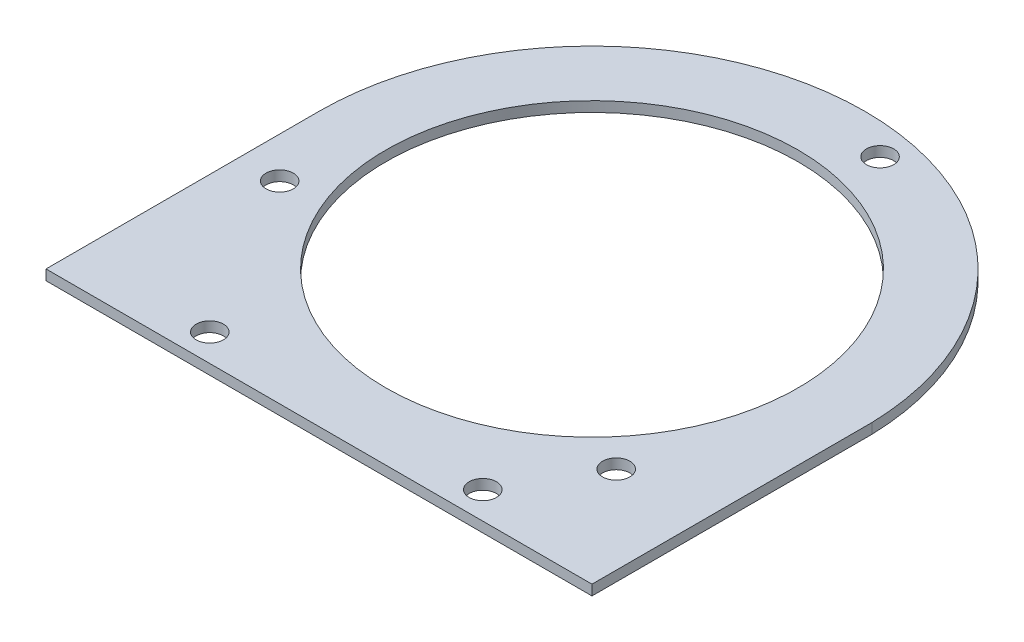
ISO-10303-21;
HEADER;
FILE_DESCRIPTION(('STEP AP214'),'2;1');
FILE_NAME('part.step','',(''),(''),'','','');
FILE_SCHEMA(('AUTOMOTIVE_DESIGN { 1 0 10303 214 1 1 1 1 }'));
ENDSEC;
DATA;
#1=APPLICATION_CONTEXT('core data for automotive mechanical design processes');
#2=APPLICATION_PROTOCOL_DEFINITION('international standard','automotive_design',2000,#1);
#3=PRODUCT_CONTEXT('',#1,'mechanical');
#4=PRODUCT('Part','Part','',(#3));
#5=PRODUCT_RELATED_PRODUCT_CATEGORY('part','',(#4));
#6=PRODUCT_DEFINITION_FORMATION('','',#4);
#7=PRODUCT_DEFINITION_CONTEXT('part definition',#1,'design');
#8=PRODUCT_DEFINITION('design','',#6,#7);
#9=PRODUCT_DEFINITION_SHAPE('','',#8);
#10=(LENGTH_UNIT() NAMED_UNIT(*) SI_UNIT(.MILLI.,.METRE.));
#11=(NAMED_UNIT(*) PLANE_ANGLE_UNIT() SI_UNIT($,.RADIAN.));
#12=(NAMED_UNIT(*) SI_UNIT($,.STERADIAN.) SOLID_ANGLE_UNIT());
#13=UNCERTAINTY_MEASURE_WITH_UNIT(LENGTH_MEASURE(1.E-05),#10,'distance_accuracy_value','');
#14=(GEOMETRIC_REPRESENTATION_CONTEXT(3) GLOBAL_UNCERTAINTY_ASSIGNED_CONTEXT((#13)) GLOBAL_UNIT_ASSIGNED_CONTEXT((#10,
#11,#12)) REPRESENTATION_CONTEXT('',''));
#15=CARTESIAN_POINT('',(0.,0.,0.));
#16=DIRECTION('',(0.,0.,1.));
#17=DIRECTION('',(1.,0.,0.));
#18=AXIS2_PLACEMENT_3D('',#15,#16,#17);
#19=CARTESIAN_POINT('',(2.28983498828939E-13,4.7625,0.0407051282049001));
#20=DIRECTION('',(0.,-1.,0.));
#21=DIRECTION('',(0.,0.,-1.));
#22=AXIS2_PLACEMENT_3D('',#19,#20,#21);
#23=PLANE('',#22);
#24=CARTESIAN_POINT('',(2.28983498828939E-13,4.7625,0.0407051282049001));
#25=DIRECTION('',(0.,1.,0.));
#26=DIRECTION('',(0.,0.,-1.));
#27=AXIS2_PLACEMENT_3D('',#24,#25,#26);
#28=CIRCLE('',#27,127.040705128219);
#29=CARTESIAN_POINT('',(127.,4.7625,-3.17500000000001));
#30=VERTEX_POINT('',#29);
#31=CARTESIAN_POINT('',(6.581727052258E-09,4.7625,-127.000000000014));
#32=VERTEX_POINT('',#31);
#33=EDGE_CURVE('E114',#30,#32,#28,.T.);
#34=ORIENTED_EDGE('',*,*,#33,.T.);
#35=CARTESIAN_POINT('',(2.63677968348475E-13,4.7625,3.05311331771918E-13));
#36=DIRECTION('',(0.,1.,0.));
#37=DIRECTION('',(0.,0.,-1.));
#38=AXIS2_PLACEMENT_3D('',#35,#36,#37);
#39=CIRCLE('',#38,127.000000000015);
#40=CARTESIAN_POINT('',(-127.000000000014,4.7625,0.));
#41=VERTEX_POINT('',#40);
#42=EDGE_CURVE('E81',#32,#41,#39,.T.);
#43=ORIENTED_EDGE('',*,*,#42,.T.);
#44=DIRECTION('',(0.,0.,1.));
#45=VECTOR('',#44,1.);
#46=CARTESIAN_POINT('',(-127.,4.7625,127.));
#47=LINE('',#46,#45);
#48=CARTESIAN_POINT('',(-127.,4.7625,127.));
#49=VERTEX_POINT('',#48);
#50=EDGE_CURVE('E85',#41,#49,#47,.T.);
#51=ORIENTED_EDGE('',*,*,#50,.T.);
#52=DIRECTION('',(1.,0.,0.));
#53=VECTOR('',#52,1.);
#54=CARTESIAN_POINT('',(127.,4.7625,127.));
#55=LINE('',#54,#53);
#56=CARTESIAN_POINT('',(127.,4.7625,127.));
#57=VERTEX_POINT('',#56);
#58=EDGE_CURVE('E89',#49,#57,#55,.T.);
#59=ORIENTED_EDGE('',*,*,#58,.T.);
#60=DIRECTION('',(0.,0.,-1.));
#61=VECTOR('',#60,1.);
#62=CARTESIAN_POINT('',(127.,4.7625,127.));
#63=LINE('',#62,#61);
#64=EDGE_CURVE('E47',#57,#30,#63,.T.);
#65=ORIENTED_EDGE('',*,*,#64,.T.);
#66=EDGE_LOOP('',(#34,#43,#51,#59,#65));
#67=FACE_BOUND('',#66,.T.);
#68=CARTESIAN_POINT('',(0.,4.7625,0.));
#69=DIRECTION('',(0.,1.,0.));
#70=DIRECTION('',(0.,0.,1.));
#71=AXIS2_PLACEMENT_3D('',#68,#69,#70);
#72=CIRCLE('',#71,95.885);
#73=CARTESIAN_POINT('',(0.,4.7625,95.885));
#74=VERTEX_POINT('',#73);
#75=EDGE_CURVE('E109',#74,#74,#72,.T.);
#76=ORIENTED_EDGE('',*,*,#75,.F.);
#77=EDGE_LOOP('',(#76));
#78=FACE_BOUND('',#77,.T.);
#79=CARTESIAN_POINT('',(-108.072773191002,4.7625,37.2124400544523));
#80=DIRECTION('',(0.,1.,0.));
#81=DIRECTION('',(0.,0.,1.));
#82=AXIS2_PLACEMENT_3D('',#79,#80,#81);
#83=CIRCLE('',#82,6.35);
#84=CARTESIAN_POINT('',(-108.072773191002,4.7625,43.5624400544523));
#85=VERTEX_POINT('',#84);
#86=EDGE_CURVE('E193',#85,#85,#83,.T.);
#87=ORIENTED_EDGE('',*,*,#86,.F.);
#88=EDGE_LOOP('',(#87));
#89=FACE_BOUND('',#88,.T.);
#90=CARTESIAN_POINT('',(-63.5,4.7625,114.3));
#91=DIRECTION('',(0.,1.,0.));
#92=DIRECTION('',(0.,0.,1.));
#93=AXIS2_PLACEMENT_3D('',#90,#91,#92);
#94=CIRCLE('',#93,6.35);
#95=CARTESIAN_POINT('',(-63.5,4.7625,120.65));
#96=VERTEX_POINT('',#95);
#97=EDGE_CURVE('E187',#96,#96,#94,.T.);
#98=ORIENTED_EDGE('',*,*,#97,.F.);
#99=EDGE_LOOP('',(#98));
#100=FACE_BOUND('',#99,.T.);
#101=CARTESIAN_POINT('',(63.5000000000001,4.7625,114.3));
#102=DIRECTION('',(0.,1.,0.));
#103=DIRECTION('',(0.,0.,-1.));
#104=AXIS2_PLACEMENT_3D('',#101,#102,#103);
#105=CIRCLE('',#104,6.34999999999999);
#106=CARTESIAN_POINT('',(63.5000000000001,4.7625,107.95));
#107=VERTEX_POINT('',#106);
#108=EDGE_CURVE('E181',#107,#107,#105,.T.);
#109=ORIENTED_EDGE('',*,*,#108,.F.);
#110=EDGE_LOOP('',(#109));
#111=FACE_BOUND('',#110,.T.);
#112=CARTESIAN_POINT('',(21.8094681715398,4.7625,-112.199987068068));
#113=DIRECTION('',(0.,1.,0.));
#114=DIRECTION('',(0.,0.,1.));
#115=AXIS2_PLACEMENT_3D('',#112,#113,#114);
#116=CIRCLE('',#115,6.34999999999998);
#117=CARTESIAN_POINT('',(21.8094681715398,4.7625,-105.849987068068));
#118=VERTEX_POINT('',#117);
#119=EDGE_CURVE('E175',#118,#118,#116,.T.);
#120=ORIENTED_EDGE('',*,*,#119,.F.);
#121=EDGE_LOOP('',(#120));
#122=FACE_BOUND('',#121,.T.);
#123=CARTESIAN_POINT('',(86.2633050194624,4.7625,74.9875470136155));
#124=DIRECTION('',(0.,1.,0.));
#125=DIRECTION('',(0.,0.,1.));
#126=AXIS2_PLACEMENT_3D('',#123,#124,#125);
#127=CIRCLE('',#126,6.34999999999999);
#128=CARTESIAN_POINT('',(86.2633050194624,4.7625,81.3375470136155));
#129=VERTEX_POINT('',#128);
#130=EDGE_CURVE('E166',#129,#129,#127,.T.);
#131=ORIENTED_EDGE('',*,*,#130,.F.);
#132=EDGE_LOOP('',(#131));
#133=FACE_BOUND('',#132,.T.);
#134=ADVANCED_FACE('F30',(#67,#78,#89,#100,#111,#122,#133),#23,.F.);
#135=CARTESIAN_POINT('',(2.28983498828939E-13,0.,0.0407051282049001));
#136=DIRECTION('',(0.,-1.,0.));
#137=DIRECTION('',(0.,0.,-1.));
#138=AXIS2_PLACEMENT_3D('',#135,#136,#137);
#139=PLANE('',#138);
#140=CARTESIAN_POINT('',(21.8094681715398,0.,-112.199987068068));
#141=DIRECTION('',(0.,1.,0.));
#142=DIRECTION('',(0.,0.,1.));
#143=AXIS2_PLACEMENT_3D('',#140,#141,#142);
#144=CIRCLE('',#143,6.34999999999998);
#145=CARTESIAN_POINT('',(21.8094681715398,0.,-105.849987068068));
#146=VERTEX_POINT('',#145);
#147=EDGE_CURVE('E172',#146,#146,#144,.T.);
#148=ORIENTED_EDGE('',*,*,#147,.T.);
#149=EDGE_LOOP('',(#148));
#150=FACE_BOUND('',#149,.T.);
#151=CARTESIAN_POINT('',(-63.5,0.,114.3));
#152=DIRECTION('',(0.,1.,0.));
#153=DIRECTION('',(0.,0.,1.));
#154=AXIS2_PLACEMENT_3D('',#151,#152,#153);
#155=CIRCLE('',#154,6.35);
#156=CARTESIAN_POINT('',(-63.5,0.,120.65));
#157=VERTEX_POINT('',#156);
#158=EDGE_CURVE('E184',#157,#157,#155,.T.);
#159=ORIENTED_EDGE('',*,*,#158,.T.);
#160=EDGE_LOOP('',(#159));
#161=FACE_BOUND('',#160,.T.);
#162=CARTESIAN_POINT('',(0.,0.,0.));
#163=DIRECTION('',(0.,1.,0.));
#164=DIRECTION('',(0.,0.,1.));
#165=AXIS2_PLACEMENT_3D('',#162,#163,#164);
#166=CIRCLE('',#165,95.885);
#167=CARTESIAN_POINT('',(0.,0.,95.885));
#168=VERTEX_POINT('',#167);
#169=EDGE_CURVE('E196',#168,#168,#166,.T.);
#170=ORIENTED_EDGE('',*,*,#169,.T.);
#171=EDGE_LOOP('',(#170));
#172=FACE_BOUND('',#171,.T.);
#173=CARTESIAN_POINT('',(2.28983498828939E-13,0.,0.0407051282049001));
#174=DIRECTION('',(0.,1.,0.));
#175=DIRECTION('',(0.,0.,-1.));
#176=AXIS2_PLACEMENT_3D('',#173,#174,#175);
#177=CIRCLE('',#176,127.040705128219);
#178=CARTESIAN_POINT('',(127.,0.,-3.17500000000001));
#179=VERTEX_POINT('',#178);
#180=CARTESIAN_POINT('',(6.581727052258E-09,0.,-127.000000000014));
#181=VERTEX_POINT('',#180);
#182=EDGE_CURVE('E105',#179,#181,#177,.T.);
#183=ORIENTED_EDGE('',*,*,#182,.F.);
#184=DIRECTION('',(0.,0.,-1.));
#185=VECTOR('',#184,1.);
#186=CARTESIAN_POINT('',(127.,0.,127.));
#187=LINE('',#186,#185);
#188=CARTESIAN_POINT('',(127.,0.,127.));
#189=VERTEX_POINT('',#188);
#190=EDGE_CURVE('E73',#189,#179,#187,.T.);
#191=ORIENTED_EDGE('',*,*,#190,.F.);
#192=DIRECTION('',(1.,0.,0.));
#193=VECTOR('',#192,1.);
#194=CARTESIAN_POINT('',(127.,0.,127.));
#195=LINE('',#194,#193);
#196=CARTESIAN_POINT('',(-127.,0.,127.));
#197=VERTEX_POINT('',#196);
#198=EDGE_CURVE('E67',#197,#189,#195,.T.);
#199=ORIENTED_EDGE('',*,*,#198,.F.);
#200=DIRECTION('',(0.,0.,1.));
#201=VECTOR('',#200,1.);
#202=CARTESIAN_POINT('',(-127.,0.,127.));
#203=LINE('',#202,#201);
#204=CARTESIAN_POINT('',(-127.000000000014,0.,0.));
#205=VERTEX_POINT('',#204);
#206=EDGE_CURVE('E96',#205,#197,#203,.T.);
#207=ORIENTED_EDGE('',*,*,#206,.F.);
#208=CARTESIAN_POINT('',(2.63677968348475E-13,0.,3.05311331771918E-13));
#209=DIRECTION('',(0.,1.,0.));
#210=DIRECTION('',(0.,0.,-1.));
#211=AXIS2_PLACEMENT_3D('',#208,#209,#210);
#212=CIRCLE('',#211,127.000000000015);
#213=EDGE_CURVE('E108',#181,#205,#212,.T.);
#214=ORIENTED_EDGE('',*,*,#213,.F.);
#215=EDGE_LOOP('',(#183,#191,#199,#207,#214));
#216=FACE_BOUND('',#215,.T.);
#217=CARTESIAN_POINT('',(-108.072773191002,0.,37.2124400544523));
#218=DIRECTION('',(0.,1.,0.));
#219=DIRECTION('',(0.,0.,1.));
#220=AXIS2_PLACEMENT_3D('',#217,#218,#219);
#221=CIRCLE('',#220,6.35);
#222=CARTESIAN_POINT('',(-108.072773191002,0.,43.5624400544523));
#223=VERTEX_POINT('',#222);
#224=EDGE_CURVE('E190',#223,#223,#221,.T.);
#225=ORIENTED_EDGE('',*,*,#224,.T.);
#226=EDGE_LOOP('',(#225));
#227=FACE_BOUND('',#226,.T.);
#228=CARTESIAN_POINT('',(63.5000000000001,0.,114.3));
#229=DIRECTION('',(0.,1.,0.));
#230=DIRECTION('',(0.,0.,-1.));
#231=AXIS2_PLACEMENT_3D('',#228,#229,#230);
#232=CIRCLE('',#231,6.34999999999999);
#233=CARTESIAN_POINT('',(63.5000000000001,0.,107.95));
#234=VERTEX_POINT('',#233);
#235=EDGE_CURVE('E178',#234,#234,#232,.T.);
#236=ORIENTED_EDGE('',*,*,#235,.T.);
#237=EDGE_LOOP('',(#236));
#238=FACE_BOUND('',#237,.T.);
#239=CARTESIAN_POINT('',(86.2633050194624,0.,74.9875470136155));
#240=DIRECTION('',(0.,1.,0.));
#241=DIRECTION('',(0.,0.,1.));
#242=AXIS2_PLACEMENT_3D('',#239,#240,#241);
#243=CIRCLE('',#242,6.34999999999999);
#244=CARTESIAN_POINT('',(86.2633050194624,0.,81.3375470136155));
#245=VERTEX_POINT('',#244);
#246=EDGE_CURVE('E169',#245,#245,#243,.T.);
#247=ORIENTED_EDGE('',*,*,#246,.T.);
#248=EDGE_LOOP('',(#247));
#249=FACE_BOUND('',#248,.T.);
#250=ADVANCED_FACE('F118',(#150,#161,#172,#216,#227,#238,#249),#139,.T.);
#251=CARTESIAN_POINT('',(2.28983498828939E-13,4.7625,0.0407051282049001));
#252=DIRECTION('',(0.,-1.,0.));
#253=DIRECTION('',(0.,0.,-1.));
#254=AXIS2_PLACEMENT_3D('',#251,#252,#253);
#255=CYLINDRICAL_SURFACE('',#254,127.040705128219);
#256=ORIENTED_EDGE('',*,*,#182,.T.);
#257=DIRECTION('',(0.,-1.,0.));
#258=VECTOR('',#257,1.);
#259=CARTESIAN_POINT('',(6.581727052258E-09,4.7625,-127.000000000014));
#260=LINE('',#259,#258);
#261=EDGE_CURVE('E11',#32,#181,#260,.T.);
#262=ORIENTED_EDGE('',*,*,#261,.F.);
#263=ORIENTED_EDGE('',*,*,#33,.F.);
#264=DIRECTION('',(0.,-1.,0.));
#265=VECTOR('',#264,1.);
#266=CARTESIAN_POINT('',(127.,4.7625,-3.17500000000001));
#267=LINE('',#266,#265);
#268=EDGE_CURVE('E101',#30,#179,#267,.T.);
#269=ORIENTED_EDGE('',*,*,#268,.T.);
#270=EDGE_LOOP('',(#256,#262,#263,#269));
#271=FACE_BOUND('',#270,.T.);
#272=ADVANCED_FACE('F32',(#271),#255,.T.);
#273=CARTESIAN_POINT('',(2.63677968348475E-13,4.7625,3.05311331771918E-13));
#274=DIRECTION('',(0.,-1.,0.));
#275=DIRECTION('',(0.,0.,-1.));
#276=AXIS2_PLACEMENT_3D('',#273,#274,#275);
#277=CYLINDRICAL_SURFACE('',#276,127.000000000015);
#278=ORIENTED_EDGE('',*,*,#213,.T.);
#279=DIRECTION('',(0.,-1.,0.));
#280=VECTOR('',#279,1.);
#281=CARTESIAN_POINT('',(-127.000000000014,4.7625,0.));
#282=LINE('',#281,#280);
#283=EDGE_CURVE('E39',#41,#205,#282,.T.);
#284=ORIENTED_EDGE('',*,*,#283,.F.);
#285=ORIENTED_EDGE('',*,*,#42,.F.);
#286=ORIENTED_EDGE('',*,*,#261,.T.);
#287=EDGE_LOOP('',(#278,#284,#285,#286));
#288=FACE_BOUND('',#287,.T.);
#289=ADVANCED_FACE('F265',(#288),#277,.T.);
#290=CARTESIAN_POINT('',(-127.,4.7625,127.));
#291=DIRECTION('',(1.,0.,0.));
#292=DIRECTION('',(0.,0.,-1.));
#293=AXIS2_PLACEMENT_3D('',#290,#291,#292);
#294=PLANE('',#293);
#295=ORIENTED_EDGE('',*,*,#206,.T.);
#296=DIRECTION('',(0.,-1.,0.));
#297=VECTOR('',#296,1.);
#298=CARTESIAN_POINT('',(-127.,4.7625,127.));
#299=LINE('',#298,#297);
#300=EDGE_CURVE('E93',#49,#197,#299,.T.);
#301=ORIENTED_EDGE('',*,*,#300,.F.);
#302=ORIENTED_EDGE('',*,*,#50,.F.);
#303=ORIENTED_EDGE('',*,*,#283,.T.);
#304=EDGE_LOOP('',(#295,#301,#302,#303));
#305=FACE_BOUND('',#304,.T.);
#306=ADVANCED_FACE('F94',(#305),#294,.F.);
#307=CARTESIAN_POINT('',(127.,4.7625,127.));
#308=DIRECTION('',(0.,0.,-1.));
#309=DIRECTION('',(-1.,0.,0.));
#310=AXIS2_PLACEMENT_3D('',#307,#308,#309);
#311=PLANE('',#310);
#312=ORIENTED_EDGE('',*,*,#198,.T.);
#313=DIRECTION('',(0.,-1.,0.));
#314=VECTOR('',#313,1.);
#315=CARTESIAN_POINT('',(127.,4.7625,127.));
#316=LINE('',#315,#314);
#317=EDGE_CURVE('E97',#57,#189,#316,.T.);
#318=ORIENTED_EDGE('',*,*,#317,.F.);
#319=ORIENTED_EDGE('',*,*,#58,.F.);
#320=ORIENTED_EDGE('',*,*,#300,.T.);
#321=EDGE_LOOP('',(#312,#318,#319,#320));
#322=FACE_BOUND('',#321,.T.);
#323=ADVANCED_FACE('F99',(#322),#311,.F.);
#324=CARTESIAN_POINT('',(127.,4.7625,127.));
#325=DIRECTION('',(-1.,0.,0.));
#326=DIRECTION('',(0.,0.,1.));
#327=AXIS2_PLACEMENT_3D('',#324,#325,#326);
#328=PLANE('',#327);
#329=ORIENTED_EDGE('',*,*,#190,.T.);
#330=ORIENTED_EDGE('',*,*,#268,.F.);
#331=ORIENTED_EDGE('',*,*,#64,.F.);
#332=ORIENTED_EDGE('',*,*,#317,.T.);
#333=EDGE_LOOP('',(#329,#330,#331,#332));
#334=FACE_BOUND('',#333,.T.);
#335=ADVANCED_FACE('F123',(#334),#328,.F.);
#336=CARTESIAN_POINT('',(0.,4.7625,0.));
#337=DIRECTION('',(0.,-1.,0.));
#338=DIRECTION('',(0.,0.,-1.));
#339=AXIS2_PLACEMENT_3D('',#336,#337,#338);
#340=CYLINDRICAL_SURFACE('',#339,95.885);
#341=ORIENTED_EDGE('',*,*,#75,.T.);
#342=EDGE_LOOP('',(#341));
#343=FACE_BOUND('',#342,.T.);
#344=ORIENTED_EDGE('',*,*,#169,.F.);
#345=EDGE_LOOP('',(#344));
#346=FACE_BOUND('',#345,.T.);
#347=ADVANCED_FACE('F125',(#343,#346),#340,.F.);
#348=CARTESIAN_POINT('',(-108.072773191002,4.7625,37.2124400544523));
#349=DIRECTION('',(0.,-1.,0.));
#350=DIRECTION('',(0.,0.,-1.));
#351=AXIS2_PLACEMENT_3D('',#348,#349,#350);
#352=CYLINDRICAL_SURFACE('',#351,6.35);
#353=ORIENTED_EDGE('',*,*,#86,.T.);
#354=EDGE_LOOP('',(#353));
#355=FACE_BOUND('',#354,.T.);
#356=ORIENTED_EDGE('',*,*,#224,.F.);
#357=EDGE_LOOP('',(#356));
#358=FACE_BOUND('',#357,.T.);
#359=ADVANCED_FACE('F131',(#355,#358),#352,.F.);
#360=CARTESIAN_POINT('',(-63.5,4.7625,114.3));
#361=DIRECTION('',(0.,-1.,0.));
#362=DIRECTION('',(0.,0.,-1.));
#363=AXIS2_PLACEMENT_3D('',#360,#361,#362);
#364=CYLINDRICAL_SURFACE('',#363,6.35);
#365=ORIENTED_EDGE('',*,*,#97,.T.);
#366=EDGE_LOOP('',(#365));
#367=FACE_BOUND('',#366,.T.);
#368=ORIENTED_EDGE('',*,*,#158,.F.);
#369=EDGE_LOOP('',(#368));
#370=FACE_BOUND('',#369,.T.);
#371=ADVANCED_FACE('F145',(#367,#370),#364,.F.);
#372=CARTESIAN_POINT('',(63.5000000000001,4.7625,114.3));
#373=DIRECTION('',(0.,-1.,0.));
#374=DIRECTION('',(0.,0.,-1.));
#375=AXIS2_PLACEMENT_3D('',#372,#373,#374);
#376=CYLINDRICAL_SURFACE('',#375,6.34999999999999);
#377=ORIENTED_EDGE('',*,*,#108,.T.);
#378=EDGE_LOOP('',(#377));
#379=FACE_BOUND('',#378,.T.);
#380=ORIENTED_EDGE('',*,*,#235,.F.);
#381=EDGE_LOOP('',(#380));
#382=FACE_BOUND('',#381,.T.);
#383=ADVANCED_FACE('F149',(#379,#382),#376,.F.);
#384=CARTESIAN_POINT('',(21.8094681715398,4.7625,-112.199987068068));
#385=DIRECTION('',(0.,-1.,0.));
#386=DIRECTION('',(0.,0.,-1.));
#387=AXIS2_PLACEMENT_3D('',#384,#385,#386);
#388=CYLINDRICAL_SURFACE('',#387,6.34999999999998);
#389=ORIENTED_EDGE('',*,*,#119,.T.);
#390=EDGE_LOOP('',(#389));
#391=FACE_BOUND('',#390,.T.);
#392=ORIENTED_EDGE('',*,*,#147,.F.);
#393=EDGE_LOOP('',(#392));
#394=FACE_BOUND('',#393,.T.);
#395=ADVANCED_FACE('F153',(#391,#394),#388,.F.);
#396=CARTESIAN_POINT('',(86.2633050194624,4.7625,74.9875470136155));
#397=DIRECTION('',(0.,-1.,0.));
#398=DIRECTION('',(0.,0.,-1.));
#399=AXIS2_PLACEMENT_3D('',#396,#397,#398);
#400=CYLINDRICAL_SURFACE('',#399,6.34999999999999);
#401=ORIENTED_EDGE('',*,*,#130,.T.);
#402=EDGE_LOOP('',(#401));
#403=FACE_BOUND('',#402,.T.);
#404=ORIENTED_EDGE('',*,*,#246,.F.);
#405=EDGE_LOOP('',(#404));
#406=FACE_BOUND('',#405,.T.);
#407=ADVANCED_FACE('F157',(#403,#406),#400,.F.);
#408=CLOSED_SHELL('',(#134,#250,#272,#289,#306,#323,#335,#347,#359,#371,#383,#395,#407));
#409=MANIFOLD_SOLID_BREP('B2',#408);
#410=ADVANCED_BREP_SHAPE_REPRESENTATION('',(#18,#409),#14);
#411=SHAPE_DEFINITION_REPRESENTATION(#9,#410);
ENDSEC;
END-ISO-10303-21;
